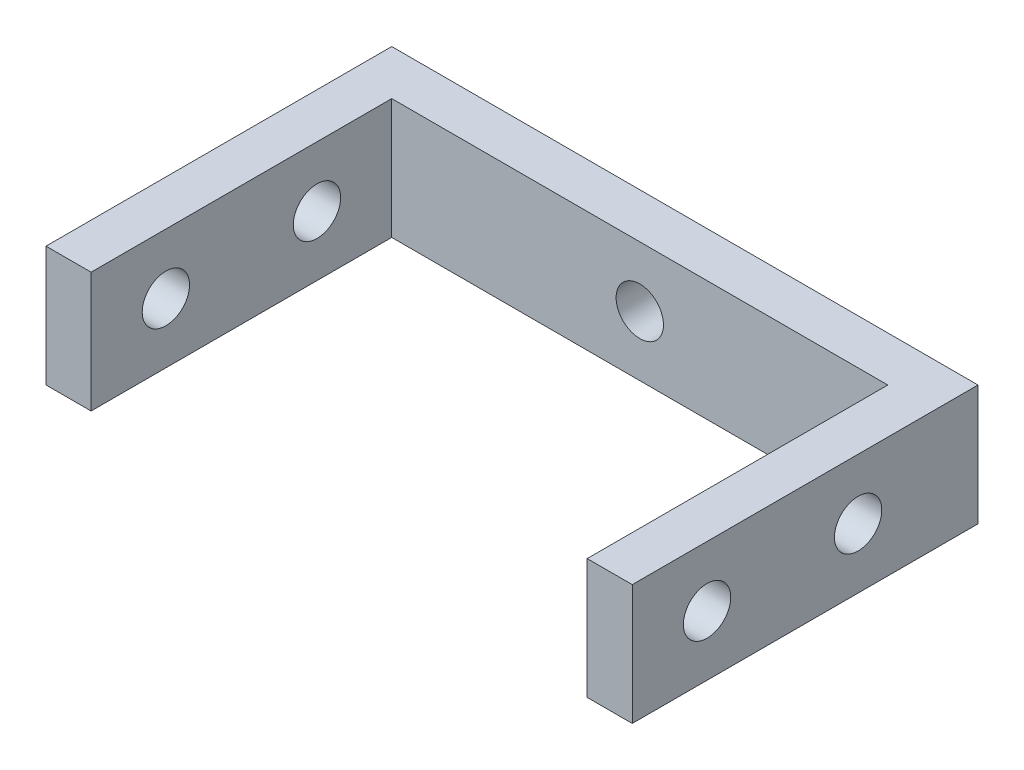
ISO-10303-21;
HEADER;
FILE_DESCRIPTION(('STEP AP214'),'2;1');
FILE_NAME('part.step','',(''),(''),'','','');
FILE_SCHEMA(('AUTOMOTIVE_DESIGN { 1 0 10303 214 1 1 1 1 }'));
ENDSEC;
DATA;
#1=APPLICATION_CONTEXT('core data for automotive mechanical design processes');
#2=APPLICATION_PROTOCOL_DEFINITION('international standard','automotive_design',2000,#1);
#3=PRODUCT_CONTEXT('',#1,'mechanical');
#4=PRODUCT('Part','Part','',(#3));
#5=PRODUCT_RELATED_PRODUCT_CATEGORY('part','',(#4));
#6=PRODUCT_DEFINITION_FORMATION('','',#4);
#7=PRODUCT_DEFINITION_CONTEXT('part definition',#1,'design');
#8=PRODUCT_DEFINITION('design','',#6,#7);
#9=PRODUCT_DEFINITION_SHAPE('','',#8);
#10=(LENGTH_UNIT() NAMED_UNIT(*) SI_UNIT(.MILLI.,.METRE.));
#11=(NAMED_UNIT(*) PLANE_ANGLE_UNIT() SI_UNIT($,.RADIAN.));
#12=(NAMED_UNIT(*) SI_UNIT($,.STERADIAN.) SOLID_ANGLE_UNIT());
#13=UNCERTAINTY_MEASURE_WITH_UNIT(LENGTH_MEASURE(1.E-05),#10,'distance_accuracy_value','');
#14=(GEOMETRIC_REPRESENTATION_CONTEXT(3) GLOBAL_UNCERTAINTY_ASSIGNED_CONTEXT((#13)) GLOBAL_UNIT_ASSIGNED_CONTEXT((#10,
#11,#12)) REPRESENTATION_CONTEXT('',''));
#15=CARTESIAN_POINT('',(0.,0.,0.));
#16=DIRECTION('',(0.,0.,1.));
#17=DIRECTION('',(1.,0.,0.));
#18=AXIS2_PLACEMENT_3D('',#15,#16,#17);
#19=CARTESIAN_POINT('',(0.,0.,3.));
#20=DIRECTION('',(0.,0.,-1.));
#21=DIRECTION('',(-1.,0.,0.));
#22=AXIS2_PLACEMENT_3D('',#19,#20,#21);
#23=PLANE('',#22);
#24=CARTESIAN_POINT('',(0.,0.,3.));
#25=DIRECTION('',(0.,0.,1.));
#26=DIRECTION('',(1.,0.,0.));
#27=AXIS2_PLACEMENT_3D('',#24,#25,#26);
#28=CIRCLE('',#27,1.575);
#29=CARTESIAN_POINT('',(1.575,0.,3.));
#30=VERTEX_POINT('',#29);
#31=EDGE_CURVE('E184',#30,#30,#28,.T.);
#32=ORIENTED_EDGE('',*,*,#31,.F.);
#33=EDGE_LOOP('',(#32));
#34=FACE_BOUND('',#33,.T.);
#35=DIRECTION('',(0.,-1.,0.));
#36=VECTOR('',#35,1.);
#37=CARTESIAN_POINT('',(16.5,4.,3.));
#38=LINE('',#37,#36);
#39=CARTESIAN_POINT('',(16.5,4.,3.));
#40=VERTEX_POINT('',#39);
#41=CARTESIAN_POINT('',(16.5,-4.,3.));
#42=VERTEX_POINT('',#41);
#43=EDGE_CURVE('E53',#40,#42,#38,.T.);
#44=ORIENTED_EDGE('',*,*,#43,.F.);
#45=DIRECTION('',(-1.,0.,0.));
#46=VECTOR('',#45,1.);
#47=CARTESIAN_POINT('',(-19.5,4.,3.));
#48=LINE('',#47,#46);
#49=CARTESIAN_POINT('',(-16.5,4.,3.));
#50=VERTEX_POINT('',#49);
#51=EDGE_CURVE('E152',#40,#50,#48,.T.);
#52=ORIENTED_EDGE('',*,*,#51,.T.);
#53=DIRECTION('',(0.,1.,0.));
#54=VECTOR('',#53,1.);
#55=CARTESIAN_POINT('',(-16.5,4.,3.));
#56=LINE('',#55,#54);
#57=CARTESIAN_POINT('',(-16.5,-4.,3.));
#58=VERTEX_POINT('',#57);
#59=EDGE_CURVE('E133',#58,#50,#56,.T.);
#60=ORIENTED_EDGE('',*,*,#59,.F.);
#61=DIRECTION('',(1.,0.,0.));
#62=VECTOR('',#61,1.);
#63=CARTESIAN_POINT('',(-19.5,-4.,3.));
#64=LINE('',#63,#62);
#65=EDGE_CURVE('E58',#58,#42,#64,.T.);
#66=ORIENTED_EDGE('',*,*,#65,.T.);
#67=EDGE_LOOP('',(#44,#52,#60,#66));
#68=FACE_BOUND('',#67,.T.);
#69=ADVANCED_FACE('F36',(#34,#68),#23,.F.);
#70=CARTESIAN_POINT('',(19.5,-4.,3.));
#71=DIRECTION('',(-1.,0.,0.));
#72=DIRECTION('',(0.,0.,1.));
#73=AXIS2_PLACEMENT_3D('',#70,#71,#72);
#74=PLANE('',#73);
#75=CARTESIAN_POINT('',(19.5,0.,18.025));
#76=DIRECTION('',(-1.,0.,0.));
#77=DIRECTION('',(0.,0.,1.));
#78=AXIS2_PLACEMENT_3D('',#75,#76,#77);
#79=CIRCLE('',#78,1.575);
#80=CARTESIAN_POINT('',(19.5,0.,19.6));
#81=VERTEX_POINT('',#80);
#82=EDGE_CURVE('E171',#81,#81,#79,.T.);
#83=ORIENTED_EDGE('',*,*,#82,.T.);
#84=EDGE_LOOP('',(#83));
#85=FACE_BOUND('',#84,.T.);
#86=CARTESIAN_POINT('',(19.5,0.,7.975));
#87=DIRECTION('',(-1.,0.,0.));
#88=DIRECTION('',(0.,0.,1.));
#89=AXIS2_PLACEMENT_3D('',#86,#87,#88);
#90=CIRCLE('',#89,1.575);
#91=CARTESIAN_POINT('',(19.5,0.,9.55));
#92=VERTEX_POINT('',#91);
#93=EDGE_CURVE('E181',#92,#92,#90,.T.);
#94=ORIENTED_EDGE('',*,*,#93,.T.);
#95=EDGE_LOOP('',(#94));
#96=FACE_BOUND('',#95,.T.);
#97=DIRECTION('',(0.,1.,0.));
#98=VECTOR('',#97,1.);
#99=CARTESIAN_POINT('',(19.5,-4.,0.));
#100=LINE('',#99,#98);
#101=CARTESIAN_POINT('',(19.5,-4.,0.));
#102=VERTEX_POINT('',#101);
#103=CARTESIAN_POINT('',(19.5,4.,0.));
#104=VERTEX_POINT('',#103);
#105=EDGE_CURVE('E106',#102,#104,#100,.T.);
#106=ORIENTED_EDGE('',*,*,#105,.T.);
#107=DIRECTION('',(0.,0.,-1.));
#108=VECTOR('',#107,1.);
#109=CARTESIAN_POINT('',(19.5,4.,3.));
#110=LINE('',#109,#108);
#111=CARTESIAN_POINT('',(19.5,4.,23.));
#112=VERTEX_POINT('',#111);
#113=EDGE_CURVE('E11',#112,#104,#110,.T.);
#114=ORIENTED_EDGE('',*,*,#113,.F.);
#115=DIRECTION('',(0.,1.,0.));
#116=VECTOR('',#115,1.);
#117=CARTESIAN_POINT('',(19.5,4.,23.));
#118=LINE('',#117,#116);
#119=CARTESIAN_POINT('',(19.5,-4.,23.));
#120=VERTEX_POINT('',#119);
#121=EDGE_CURVE('E104',#120,#112,#118,.T.);
#122=ORIENTED_EDGE('',*,*,#121,.F.);
#123=DIRECTION('',(0.,0.,-1.));
#124=VECTOR('',#123,1.);
#125=CARTESIAN_POINT('',(19.5,-4.,3.));
#126=LINE('',#125,#124);
#127=EDGE_CURVE('E156',#120,#102,#126,.T.);
#128=ORIENTED_EDGE('',*,*,#127,.T.);
#129=EDGE_LOOP('',(#106,#114,#122,#128));
#130=FACE_BOUND('',#129,.T.);
#131=ADVANCED_FACE('F38',(#85,#96,#130),#74,.F.);
#132=CARTESIAN_POINT('',(-19.5,4.,3.));
#133=DIRECTION('',(0.,-1.,0.));
#134=DIRECTION('',(0.,0.,-1.));
#135=AXIS2_PLACEMENT_3D('',#132,#133,#134);
#136=PLANE('',#135);
#137=DIRECTION('',(-1.,0.,0.));
#138=VECTOR('',#137,1.);
#139=CARTESIAN_POINT('',(-19.5,4.,0.));
#140=LINE('',#139,#138);
#141=CARTESIAN_POINT('',(-19.5,4.,0.));
#142=VERTEX_POINT('',#141);
#143=EDGE_CURVE('E158',#104,#142,#140,.T.);
#144=ORIENTED_EDGE('',*,*,#143,.T.);
#145=DIRECTION('',(0.,0.,-1.));
#146=VECTOR('',#145,1.);
#147=CARTESIAN_POINT('',(-19.5,4.,3.));
#148=LINE('',#147,#146);
#149=CARTESIAN_POINT('',(-19.5,4.,23.));
#150=VERTEX_POINT('',#149);
#151=EDGE_CURVE('E45',#150,#142,#148,.T.);
#152=ORIENTED_EDGE('',*,*,#151,.F.);
#153=DIRECTION('',(-1.,0.,0.));
#154=VECTOR('',#153,1.);
#155=CARTESIAN_POINT('',(-19.5,4.,23.));
#156=LINE('',#155,#154);
#157=CARTESIAN_POINT('',(-16.5,4.,23.));
#158=VERTEX_POINT('',#157);
#159=EDGE_CURVE('E141',#158,#150,#156,.T.);
#160=ORIENTED_EDGE('',*,*,#159,.F.);
#161=DIRECTION('',(0.,0.,-1.));
#162=VECTOR('',#161,1.);
#163=CARTESIAN_POINT('',(-16.5,4.,23.));
#164=LINE('',#163,#162);
#165=EDGE_CURVE('E144',#158,#50,#164,.T.);
#166=ORIENTED_EDGE('',*,*,#165,.T.);
#167=ORIENTED_EDGE('',*,*,#51,.F.);
#168=DIRECTION('',(0.,0.,-1.));
#169=VECTOR('',#168,1.);
#170=CARTESIAN_POINT('',(16.5,4.,23.));
#171=LINE('',#170,#169);
#172=CARTESIAN_POINT('',(16.5,4.,23.));
#173=VERTEX_POINT('',#172);
#174=EDGE_CURVE('E112',#173,#40,#171,.T.);
#175=ORIENTED_EDGE('',*,*,#174,.F.);
#176=DIRECTION('',(-1.,0.,0.));
#177=VECTOR('',#176,1.);
#178=CARTESIAN_POINT('',(19.5,4.,23.));
#179=LINE('',#178,#177);
#180=EDGE_CURVE('E109',#112,#173,#179,.T.);
#181=ORIENTED_EDGE('',*,*,#180,.F.);
#182=ORIENTED_EDGE('',*,*,#113,.T.);
#183=EDGE_LOOP('',(#144,#152,#160,#166,#167,#175,#181,#182));
#184=FACE_BOUND('',#183,.T.);
#185=ADVANCED_FACE('F110',(#184),#136,.F.);
#186=CARTESIAN_POINT('',(-19.5,-4.,3.));
#187=DIRECTION('',(1.,0.,0.));
#188=DIRECTION('',(0.,0.,-1.));
#189=AXIS2_PLACEMENT_3D('',#186,#187,#188);
#190=PLANE('',#189);
#191=CARTESIAN_POINT('',(-19.5,0.,18.025));
#192=DIRECTION('',(-1.,0.,0.));
#193=DIRECTION('',(0.,0.,1.));
#194=AXIS2_PLACEMENT_3D('',#191,#192,#193);
#195=CIRCLE('',#194,1.575);
#196=CARTESIAN_POINT('',(-19.5,0.,19.6));
#197=VERTEX_POINT('',#196);
#198=EDGE_CURVE('E176',#197,#197,#195,.T.);
#199=ORIENTED_EDGE('',*,*,#198,.F.);
#200=EDGE_LOOP('',(#199));
#201=FACE_BOUND('',#200,.T.);
#202=CARTESIAN_POINT('',(-19.5,0.,7.975));
#203=DIRECTION('',(-1.,0.,0.));
#204=DIRECTION('',(0.,0.,1.));
#205=AXIS2_PLACEMENT_3D('',#202,#203,#204);
#206=CIRCLE('',#205,1.575);
#207=CARTESIAN_POINT('',(-19.5,0.,9.55));
#208=VERTEX_POINT('',#207);
#209=EDGE_CURVE('E189',#208,#208,#206,.T.);
#210=ORIENTED_EDGE('',*,*,#209,.F.);
#211=EDGE_LOOP('',(#210));
#212=FACE_BOUND('',#211,.T.);
#213=DIRECTION('',(0.,-1.,0.));
#214=VECTOR('',#213,1.);
#215=CARTESIAN_POINT('',(-19.5,-4.,0.));
#216=LINE('',#215,#214);
#217=CARTESIAN_POINT('',(-19.5,-4.,0.));
#218=VERTEX_POINT('',#217);
#219=EDGE_CURVE('E160',#142,#218,#216,.T.);
#220=ORIENTED_EDGE('',*,*,#219,.T.);
#221=DIRECTION('',(0.,0.,-1.));
#222=VECTOR('',#221,1.);
#223=CARTESIAN_POINT('',(-19.5,-4.,3.));
#224=LINE('',#223,#222);
#225=CARTESIAN_POINT('',(-19.5,-4.,23.));
#226=VERTEX_POINT('',#225);
#227=EDGE_CURVE('E164',#226,#218,#224,.T.);
#228=ORIENTED_EDGE('',*,*,#227,.F.);
#229=DIRECTION('',(0.,-1.,0.));
#230=VECTOR('',#229,1.);
#231=CARTESIAN_POINT('',(-19.5,4.,23.));
#232=LINE('',#231,#230);
#233=EDGE_CURVE('E134',#150,#226,#232,.T.);
#234=ORIENTED_EDGE('',*,*,#233,.F.);
#235=ORIENTED_EDGE('',*,*,#151,.T.);
#236=EDGE_LOOP('',(#220,#228,#234,#235));
#237=FACE_BOUND('',#236,.T.);
#238=ADVANCED_FACE('F217',(#201,#212,#237),#190,.F.);
#239=CARTESIAN_POINT('',(-19.5,-4.,3.));
#240=DIRECTION('',(0.,1.,0.));
#241=DIRECTION('',(0.,0.,1.));
#242=AXIS2_PLACEMENT_3D('',#239,#240,#241);
#243=PLANE('',#242);
#244=DIRECTION('',(1.,0.,0.));
#245=VECTOR('',#244,1.);
#246=CARTESIAN_POINT('',(-19.5,-4.,0.));
#247=LINE('',#246,#245);
#248=EDGE_CURVE('E154',#218,#102,#247,.T.);
#249=ORIENTED_EDGE('',*,*,#248,.T.);
#250=ORIENTED_EDGE('',*,*,#127,.F.);
#251=DIRECTION('',(1.,0.,0.));
#252=VECTOR('',#251,1.);
#253=CARTESIAN_POINT('',(19.5,-4.,23.));
#254=LINE('',#253,#252);
#255=CARTESIAN_POINT('',(16.5,-4.,23.));
#256=VERTEX_POINT('',#255);
#257=EDGE_CURVE('E120',#256,#120,#254,.T.);
#258=ORIENTED_EDGE('',*,*,#257,.F.);
#259=DIRECTION('',(0.,0.,-1.));
#260=VECTOR('',#259,1.);
#261=CARTESIAN_POINT('',(16.5,-4.,23.));
#262=LINE('',#261,#260);
#263=EDGE_CURVE('E128',#256,#42,#262,.T.);
#264=ORIENTED_EDGE('',*,*,#263,.T.);
#265=ORIENTED_EDGE('',*,*,#65,.F.);
#266=DIRECTION('',(0.,0.,-1.));
#267=VECTOR('',#266,1.);
#268=CARTESIAN_POINT('',(-16.5,-4.,23.));
#269=LINE('',#268,#267);
#270=CARTESIAN_POINT('',(-16.5,-4.,23.));
#271=VERTEX_POINT('',#270);
#272=EDGE_CURVE('E149',#271,#58,#269,.T.);
#273=ORIENTED_EDGE('',*,*,#272,.F.);
#274=DIRECTION('',(1.,0.,0.));
#275=VECTOR('',#274,1.);
#276=CARTESIAN_POINT('',(-19.5,-4.,23.));
#277=LINE('',#276,#275);
#278=EDGE_CURVE('E137',#226,#271,#277,.T.);
#279=ORIENTED_EDGE('',*,*,#278,.F.);
#280=ORIENTED_EDGE('',*,*,#227,.T.);
#281=EDGE_LOOP('',(#249,#250,#258,#264,#265,#273,#279,#280));
#282=FACE_BOUND('',#281,.T.);
#283=ADVANCED_FACE('F214',(#282),#243,.F.);
#284=CARTESIAN_POINT('',(0.,0.,0.));
#285=DIRECTION('',(0.,0.,-1.));
#286=DIRECTION('',(-1.,0.,0.));
#287=AXIS2_PLACEMENT_3D('',#284,#285,#286);
#288=PLANE('',#287);
#289=CARTESIAN_POINT('',(0.,0.,0.));
#290=DIRECTION('',(0.,0.,1.));
#291=DIRECTION('',(1.,0.,0.));
#292=AXIS2_PLACEMENT_3D('',#289,#290,#291);
#293=CIRCLE('',#292,1.575);
#294=CARTESIAN_POINT('',(1.575,0.,0.));
#295=VERTEX_POINT('',#294);
#296=EDGE_CURVE('E191',#295,#295,#293,.T.);
#297=ORIENTED_EDGE('',*,*,#296,.T.);
#298=EDGE_LOOP('',(#297));
#299=FACE_BOUND('',#298,.T.);
#300=ORIENTED_EDGE('',*,*,#105,.F.);
#301=ORIENTED_EDGE('',*,*,#248,.F.);
#302=ORIENTED_EDGE('',*,*,#219,.F.);
#303=ORIENTED_EDGE('',*,*,#143,.F.);
#304=EDGE_LOOP('',(#300,#301,#302,#303));
#305=FACE_BOUND('',#304,.T.);
#306=ADVANCED_FACE('F211',(#299,#305),#288,.T.);
#307=CARTESIAN_POINT('',(-16.5,4.,23.));
#308=DIRECTION('',(-1.,0.,0.));
#309=DIRECTION('',(0.,0.,1.));
#310=AXIS2_PLACEMENT_3D('',#307,#308,#309);
#311=PLANE('',#310);
#312=CARTESIAN_POINT('',(-16.5,0.,18.025));
#313=DIRECTION('',(-1.,0.,0.));
#314=DIRECTION('',(0.,0.,1.));
#315=AXIS2_PLACEMENT_3D('',#312,#313,#314);
#316=CIRCLE('',#315,1.575);
#317=CARTESIAN_POINT('',(-16.5,0.,19.6));
#318=VERTEX_POINT('',#317);
#319=EDGE_CURVE('E122',#318,#318,#316,.T.);
#320=ORIENTED_EDGE('',*,*,#319,.T.);
#321=EDGE_LOOP('',(#320));
#322=FACE_BOUND('',#321,.T.);
#323=CARTESIAN_POINT('',(-16.5,0.,7.975));
#324=DIRECTION('',(-1.,0.,0.));
#325=DIRECTION('',(0.,0.,1.));
#326=AXIS2_PLACEMENT_3D('',#323,#324,#325);
#327=CIRCLE('',#326,1.575);
#328=CARTESIAN_POINT('',(-16.5,0.,9.55));
#329=VERTEX_POINT('',#328);
#330=EDGE_CURVE('E170',#329,#329,#327,.T.);
#331=ORIENTED_EDGE('',*,*,#330,.T.);
#332=EDGE_LOOP('',(#331));
#333=FACE_BOUND('',#332,.T.);
#334=ORIENTED_EDGE('',*,*,#59,.T.);
#335=ORIENTED_EDGE('',*,*,#165,.F.);
#336=DIRECTION('',(0.,1.,0.));
#337=VECTOR('',#336,1.);
#338=CARTESIAN_POINT('',(-16.5,4.,23.));
#339=LINE('',#338,#337);
#340=EDGE_CURVE('E139',#271,#158,#339,.T.);
#341=ORIENTED_EDGE('',*,*,#340,.F.);
#342=ORIENTED_EDGE('',*,*,#272,.T.);
#343=EDGE_LOOP('',(#334,#335,#341,#342));
#344=FACE_BOUND('',#343,.T.);
#345=ADVANCED_FACE('F209',(#322,#333,#344),#311,.F.);
#346=CARTESIAN_POINT('',(0.,0.,23.));
#347=DIRECTION('',(0.,0.,1.));
#348=DIRECTION('',(1.,0.,0.));
#349=AXIS2_PLACEMENT_3D('',#346,#347,#348);
#350=PLANE('',#349);
#351=ORIENTED_EDGE('',*,*,#233,.T.);
#352=ORIENTED_EDGE('',*,*,#278,.T.);
#353=ORIENTED_EDGE('',*,*,#340,.T.);
#354=ORIENTED_EDGE('',*,*,#159,.T.);
#355=EDGE_LOOP('',(#351,#352,#353,#354));
#356=FACE_BOUND('',#355,.T.);
#357=ADVANCED_FACE('F246',(#356),#350,.T.);
#358=CARTESIAN_POINT('',(16.5,4.,23.));
#359=DIRECTION('',(1.,0.,0.));
#360=DIRECTION('',(0.,1.,0.));
#361=AXIS2_PLACEMENT_3D('',#358,#359,#360);
#362=PLANE('',#361);
#363=CARTESIAN_POINT('',(16.5,0.,18.025));
#364=DIRECTION('',(1.,0.,0.));
#365=DIRECTION('',(0.,1.,0.));
#366=AXIS2_PLACEMENT_3D('',#363,#364,#365);
#367=CIRCLE('',#366,1.575);
#368=CARTESIAN_POINT('',(16.5,1.575,18.025));
#369=VERTEX_POINT('',#368);
#370=EDGE_CURVE('E40',#369,#369,#367,.T.);
#371=ORIENTED_EDGE('',*,*,#370,.T.);
#372=EDGE_LOOP('',(#371));
#373=FACE_BOUND('',#372,.T.);
#374=CARTESIAN_POINT('',(16.5,0.,7.975));
#375=DIRECTION('',(1.,0.,0.));
#376=DIRECTION('',(0.,1.,0.));
#377=AXIS2_PLACEMENT_3D('',#374,#375,#376);
#378=CIRCLE('',#377,1.575);
#379=CARTESIAN_POINT('',(16.5,1.575,7.975));
#380=VERTEX_POINT('',#379);
#381=EDGE_CURVE('E168',#380,#380,#378,.T.);
#382=ORIENTED_EDGE('',*,*,#381,.T.);
#383=EDGE_LOOP('',(#382));
#384=FACE_BOUND('',#383,.T.);
#385=ORIENTED_EDGE('',*,*,#43,.T.);
#386=ORIENTED_EDGE('',*,*,#263,.F.);
#387=DIRECTION('',(0.,-1.,0.));
#388=VECTOR('',#387,1.);
#389=CARTESIAN_POINT('',(16.5,4.,23.));
#390=LINE('',#389,#388);
#391=EDGE_CURVE('E115',#173,#256,#390,.T.);
#392=ORIENTED_EDGE('',*,*,#391,.F.);
#393=ORIENTED_EDGE('',*,*,#174,.T.);
#394=EDGE_LOOP('',(#385,#386,#392,#393));
#395=FACE_BOUND('',#394,.T.);
#396=ADVANCED_FACE('F253',(#373,#384,#395),#362,.F.);
#397=CARTESIAN_POINT('',(0.,0.,23.));
#398=DIRECTION('',(0.,0.,-1.));
#399=DIRECTION('',(-1.,0.,0.));
#400=AXIS2_PLACEMENT_3D('',#397,#398,#399);
#401=PLANE('',#400);
#402=ORIENTED_EDGE('',*,*,#121,.T.);
#403=ORIENTED_EDGE('',*,*,#180,.T.);
#404=ORIENTED_EDGE('',*,*,#391,.T.);
#405=ORIENTED_EDGE('',*,*,#257,.T.);
#406=EDGE_LOOP('',(#402,#403,#404,#405));
#407=FACE_BOUND('',#406,.T.);
#408=ADVANCED_FACE('F118',(#407),#401,.F.);
#409=CARTESIAN_POINT('',(19.5,0.,7.975));
#410=DIRECTION('',(-1.,0.,0.));
#411=DIRECTION('',(0.,0.,1.));
#412=AXIS2_PLACEMENT_3D('',#409,#410,#411);
#413=CYLINDRICAL_SURFACE('',#412,1.575);
#414=ORIENTED_EDGE('',*,*,#93,.F.);
#415=EDGE_LOOP('',(#414));
#416=FACE_BOUND('',#415,.T.);
#417=ORIENTED_EDGE('',*,*,#381,.F.);
#418=EDGE_LOOP('',(#417));
#419=FACE_BOUND('',#418,.T.);
#420=ADVANCED_FACE('F267',(#416,#419),#413,.F.);
#421=CARTESIAN_POINT('',(19.5,0.,18.025));
#422=DIRECTION('',(-1.,0.,0.));
#423=DIRECTION('',(0.,0.,1.));
#424=AXIS2_PLACEMENT_3D('',#421,#422,#423);
#425=CYLINDRICAL_SURFACE('',#424,1.575);
#426=ORIENTED_EDGE('',*,*,#82,.F.);
#427=EDGE_LOOP('',(#426));
#428=FACE_BOUND('',#427,.T.);
#429=ORIENTED_EDGE('',*,*,#370,.F.);
#430=EDGE_LOOP('',(#429));
#431=FACE_BOUND('',#430,.T.);
#432=ADVANCED_FACE('F273',(#428,#431),#425,.F.);
#433=ORIENTED_EDGE('',*,*,#209,.T.);
#434=EDGE_LOOP('',(#433));
#435=FACE_BOUND('',#434,.T.);
#436=ORIENTED_EDGE('',*,*,#330,.F.);
#437=EDGE_LOOP('',(#436));
#438=FACE_BOUND('',#437,.T.);
#439=ADVANCED_FACE('F276',(#435,#438),#413,.F.);
#440=ORIENTED_EDGE('',*,*,#198,.T.);
#441=EDGE_LOOP('',(#440));
#442=FACE_BOUND('',#441,.T.);
#443=ORIENTED_EDGE('',*,*,#319,.F.);
#444=EDGE_LOOP('',(#443));
#445=FACE_BOUND('',#444,.T.);
#446=ADVANCED_FACE('F284',(#442,#445),#425,.F.);
#447=CARTESIAN_POINT('',(0.,0.,0.));
#448=DIRECTION('',(0.,0.,1.));
#449=DIRECTION('',(1.,0.,0.));
#450=AXIS2_PLACEMENT_3D('',#447,#448,#449);
#451=CYLINDRICAL_SURFACE('',#450,1.575);
#452=ORIENTED_EDGE('',*,*,#296,.F.);
#453=EDGE_LOOP('',(#452));
#454=FACE_BOUND('',#453,.T.);
#455=ORIENTED_EDGE('',*,*,#31,.T.);
#456=EDGE_LOOP('',(#455));
#457=FACE_BOUND('',#456,.T.);
#458=ADVANCED_FACE('F200',(#454,#457),#451,.F.);
#459=CLOSED_SHELL('',(#69,#131,#185,#238,#283,#306,#345,#357,#396,#408,#420,#432,#439,#446,#458));
#460=MANIFOLD_SOLID_BREP('B2',#459);
#461=ADVANCED_BREP_SHAPE_REPRESENTATION('',(#18,#460),#14);
#462=SHAPE_DEFINITION_REPRESENTATION(#9,#461);
ENDSEC;
END-ISO-10303-21;
